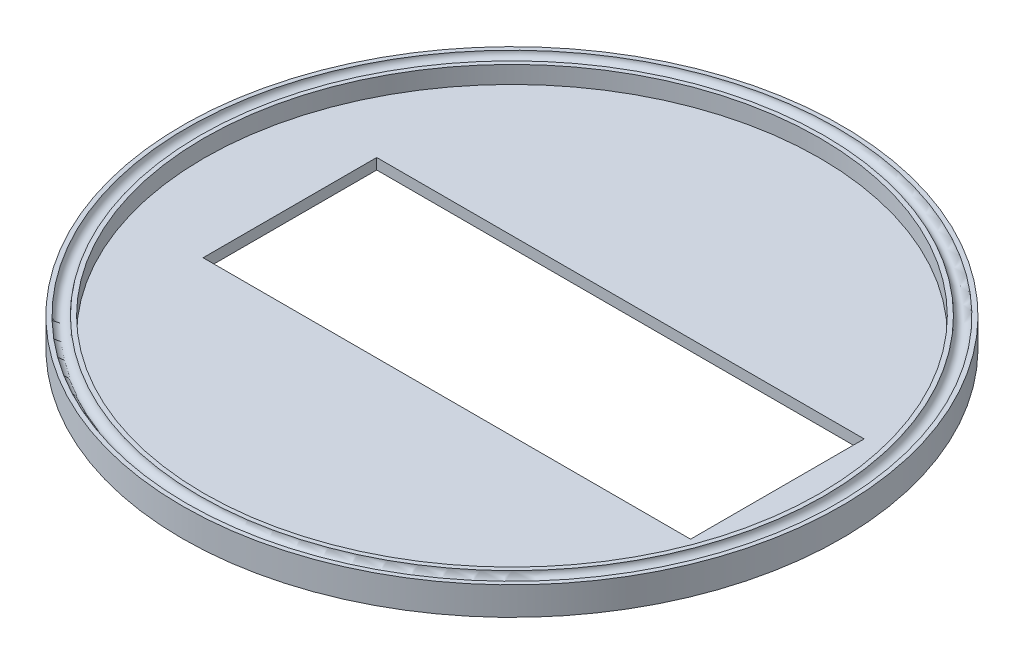
ISO-10303-21;
HEADER;
FILE_DESCRIPTION(('STEP AP214'),'2;1');
FILE_NAME('part.step','',(''),(''),'','','');
FILE_SCHEMA(('AUTOMOTIVE_DESIGN { 1 0 10303 214 1 1 1 1 }'));
ENDSEC;
DATA;
#1=APPLICATION_CONTEXT('core data for automotive mechanical design processes');
#2=APPLICATION_PROTOCOL_DEFINITION('international standard','automotive_design',2000,#1);
#3=PRODUCT_CONTEXT('',#1,'mechanical');
#4=PRODUCT('Part','Part','',(#3));
#5=PRODUCT_RELATED_PRODUCT_CATEGORY('part','',(#4));
#6=PRODUCT_DEFINITION_FORMATION('','',#4);
#7=PRODUCT_DEFINITION_CONTEXT('part definition',#1,'design');
#8=PRODUCT_DEFINITION('design','',#6,#7);
#9=PRODUCT_DEFINITION_SHAPE('','',#8);
#10=(LENGTH_UNIT() NAMED_UNIT(*) SI_UNIT(.MILLI.,.METRE.));
#11=(NAMED_UNIT(*) PLANE_ANGLE_UNIT() SI_UNIT($,.RADIAN.));
#12=(NAMED_UNIT(*) SI_UNIT($,.STERADIAN.) SOLID_ANGLE_UNIT());
#13=UNCERTAINTY_MEASURE_WITH_UNIT(LENGTH_MEASURE(1.E-05),#10,'distance_accuracy_value','');
#14=(GEOMETRIC_REPRESENTATION_CONTEXT(3) GLOBAL_UNCERTAINTY_ASSIGNED_CONTEXT((#13)) GLOBAL_UNIT_ASSIGNED_CONTEXT((#10,
#11,#12)) REPRESENTATION_CONTEXT('',''));
#15=CARTESIAN_POINT('',(0.,0.,0.));
#16=DIRECTION('',(0.,0.,1.));
#17=DIRECTION('',(1.,0.,0.));
#18=AXIS2_PLACEMENT_3D('',#15,#16,#17);
#19=CARTESIAN_POINT('',(0.,6.5,0.));
#20=DIRECTION('',(0.,1.,0.));
#21=DIRECTION('',(0.,0.,1.));
#22=AXIS2_PLACEMENT_3D('',#19,#20,#21);
#23=PLANE('',#22);
#24=CARTESIAN_POINT('',(0.,6.5,0.));
#25=DIRECTION('',(0.,1.,0.));
#26=DIRECTION('',(0.,0.,1.));
#27=AXIS2_PLACEMENT_3D('',#24,#25,#26);
#28=CIRCLE('',#27,75.925);
#29=CARTESIAN_POINT('',(0.,6.5,75.925));
#30=VERTEX_POINT('',#29);
#31=EDGE_CURVE('E135',#30,#30,#28,.T.);
#32=ORIENTED_EDGE('',*,*,#31,.T.);
#33=EDGE_LOOP('',(#32));
#34=FACE_BOUND('',#33,.T.);
#35=CARTESIAN_POINT('',(0.,6.5,0.));
#36=DIRECTION('',(0.,1.,0.));
#37=DIRECTION('',(0.,0.,1.));
#38=AXIS2_PLACEMENT_3D('',#35,#36,#37);
#39=CIRCLE('',#38,74.925);
#40=CARTESIAN_POINT('',(0.,6.5,74.925));
#41=VERTEX_POINT('',#40);
#42=EDGE_CURVE('E12',#41,#41,#39,.T.);
#43=ORIENTED_EDGE('',*,*,#42,.F.);
#44=EDGE_LOOP('',(#43));
#45=FACE_BOUND('',#44,.T.);
#46=ADVANCED_FACE('F57',(#34,#45),#23,.T.);
#47=CARTESIAN_POINT('',(0.,6.5,0.));
#48=DIRECTION('',(0.,1.,0.));
#49=DIRECTION('',(0.,0.,1.));
#50=AXIS2_PLACEMENT_3D('',#47,#48,#49);
#51=CIRCLE('',#50,70.925);
#52=CARTESIAN_POINT('',(0.,6.5,70.925));
#53=VERTEX_POINT('',#52);
#54=EDGE_CURVE('E211',#53,#53,#51,.T.);
#55=ORIENTED_EDGE('',*,*,#54,.F.);
#56=EDGE_LOOP('',(#55));
#57=FACE_BOUND('',#56,.T.);
#58=CARTESIAN_POINT('',(0.,6.5,0.));
#59=DIRECTION('',(0.,-1.,0.));
#60=DIRECTION('',(0.,0.,-1.));
#61=AXIS2_PLACEMENT_3D('',#58,#59,#60);
#62=CIRCLE('',#61,71.925);
#63=CARTESIAN_POINT('',(0.,6.5,71.925));
#64=VERTEX_POINT('',#63);
#65=EDGE_CURVE('E66',#64,#64,#62,.T.);
#66=ORIENTED_EDGE('',*,*,#65,.F.);
#67=EDGE_LOOP('',(#66));
#68=FACE_BOUND('',#67,.T.);
#69=ADVANCED_FACE('F169',(#57,#68),#23,.T.);
#70=CARTESIAN_POINT('',(0.,2.5,0.));
#71=DIRECTION('',(0.,1.,0.));
#72=DIRECTION('',(0.,0.,1.));
#73=AXIS2_PLACEMENT_3D('',#70,#71,#72);
#74=PLANE('',#73);
#75=DIRECTION('',(0.,0.,-1.));
#76=VECTOR('',#75,1.);
#77=CARTESIAN_POINT('',(61.15,2.5,20.));
#78=LINE('',#77,#76);
#79=CARTESIAN_POINT('',(61.15,2.5,20.));
#80=VERTEX_POINT('',#79);
#81=CARTESIAN_POINT('',(61.15,2.5,-20.));
#82=VERTEX_POINT('',#81);
#83=EDGE_CURVE('E107',#80,#82,#78,.T.);
#84=ORIENTED_EDGE('',*,*,#83,.F.);
#85=DIRECTION('',(1.,0.,0.));
#86=VECTOR('',#85,1.);
#87=CARTESIAN_POINT('',(61.15,2.5,20.));
#88=LINE('',#87,#86);
#89=CARTESIAN_POINT('',(-51.15,2.5,20.));
#90=VERTEX_POINT('',#89);
#91=EDGE_CURVE('E128',#90,#80,#88,.T.);
#92=ORIENTED_EDGE('',*,*,#91,.F.);
#93=DIRECTION('',(0.,0.,1.));
#94=VECTOR('',#93,1.);
#95=CARTESIAN_POINT('',(-51.15,2.5,20.));
#96=LINE('',#95,#94);
#97=CARTESIAN_POINT('',(-51.15,2.5,-20.));
#98=VERTEX_POINT('',#97);
#99=EDGE_CURVE('E132',#98,#90,#96,.T.);
#100=ORIENTED_EDGE('',*,*,#99,.F.);
#101=DIRECTION('',(-1.,0.,0.));
#102=VECTOR('',#101,1.);
#103=CARTESIAN_POINT('',(61.15,2.5,-20.));
#104=LINE('',#103,#102);
#105=EDGE_CURVE('E144',#82,#98,#104,.T.);
#106=ORIENTED_EDGE('',*,*,#105,.F.);
#107=EDGE_LOOP('',(#84,#92,#100,#106));
#108=FACE_BOUND('',#107,.T.);
#109=CARTESIAN_POINT('',(0.,2.5,0.));
#110=DIRECTION('',(0.,1.,0.));
#111=DIRECTION('',(0.,0.,1.));
#112=AXIS2_PLACEMENT_3D('',#109,#110,#111);
#113=CIRCLE('',#112,70.925);
#114=CARTESIAN_POINT('',(0.,2.5,70.925));
#115=VERTEX_POINT('',#114);
#116=EDGE_CURVE('E162',#115,#115,#113,.F.);
#117=ORIENTED_EDGE('',*,*,#116,.F.);
#118=EDGE_LOOP('',(#117));
#119=FACE_BOUND('',#118,.T.);
#120=ADVANCED_FACE('F171',(#108,#119),#74,.T.);
#121=CARTESIAN_POINT('',(0.,2.5,0.));
#122=DIRECTION('',(0.,-1.,0.));
#123=DIRECTION('',(0.,0.,-1.));
#124=AXIS2_PLACEMENT_3D('',#121,#122,#123);
#125=CYLINDRICAL_SURFACE('',#124,75.925);
#126=CARTESIAN_POINT('',(0.,0.,0.));
#127=DIRECTION('',(0.,1.,0.));
#128=DIRECTION('',(0.,0.,1.));
#129=AXIS2_PLACEMENT_3D('',#126,#127,#128);
#130=CIRCLE('',#129,75.925);
#131=CARTESIAN_POINT('',(0.,0.,75.925));
#132=VERTEX_POINT('',#131);
#133=EDGE_CURVE('E153',#132,#132,#130,.T.);
#134=ORIENTED_EDGE('',*,*,#133,.T.);
#135=EDGE_LOOP('',(#134));
#136=FACE_BOUND('',#135,.T.);
#137=ORIENTED_EDGE('',*,*,#31,.F.);
#138=EDGE_LOOP('',(#137));
#139=FACE_BOUND('',#138,.T.);
#140=ADVANCED_FACE('F59',(#136,#139),#125,.T.);
#141=CARTESIAN_POINT('',(0.,0.,0.));
#142=DIRECTION('',(0.,1.,0.));
#143=DIRECTION('',(0.,0.,1.));
#144=AXIS2_PLACEMENT_3D('',#141,#142,#143);
#145=PLANE('',#144);
#146=DIRECTION('',(1.,0.,0.));
#147=VECTOR('',#146,1.);
#148=CARTESIAN_POINT('',(61.15,0.,20.));
#149=LINE('',#148,#147);
#150=CARTESIAN_POINT('',(-51.15,0.,20.));
#151=VERTEX_POINT('',#150);
#152=CARTESIAN_POINT('',(61.15,0.,20.));
#153=VERTEX_POINT('',#152);
#154=EDGE_CURVE('E113',#151,#153,#149,.T.);
#155=ORIENTED_EDGE('',*,*,#154,.T.);
#156=DIRECTION('',(0.,0.,-1.));
#157=VECTOR('',#156,1.);
#158=CARTESIAN_POINT('',(61.15,0.,20.));
#159=LINE('',#158,#157);
#160=CARTESIAN_POINT('',(61.15,0.,-20.));
#161=VERTEX_POINT('',#160);
#162=EDGE_CURVE('E104',#153,#161,#159,.T.);
#163=ORIENTED_EDGE('',*,*,#162,.T.);
#164=DIRECTION('',(-1.,0.,0.));
#165=VECTOR('',#164,1.);
#166=CARTESIAN_POINT('',(61.15,0.,-20.));
#167=LINE('',#166,#165);
#168=CARTESIAN_POINT('',(-51.15,0.,-20.));
#169=VERTEX_POINT('',#168);
#170=EDGE_CURVE('E117',#161,#169,#167,.T.);
#171=ORIENTED_EDGE('',*,*,#170,.T.);
#172=DIRECTION('',(0.,0.,1.));
#173=VECTOR('',#172,1.);
#174=CARTESIAN_POINT('',(-51.15,0.,20.));
#175=LINE('',#174,#173);
#176=EDGE_CURVE('E122',#169,#151,#175,.T.);
#177=ORIENTED_EDGE('',*,*,#176,.T.);
#178=EDGE_LOOP('',(#155,#163,#171,#177));
#179=FACE_BOUND('',#178,.T.);
#180=ORIENTED_EDGE('',*,*,#133,.F.);
#181=EDGE_LOOP('',(#180));
#182=FACE_BOUND('',#181,.T.);
#183=ADVANCED_FACE('F124',(#179,#182),#145,.F.);
#184=CARTESIAN_POINT('',(61.15,0.,20.));
#185=DIRECTION('',(1.,0.,0.));
#186=DIRECTION('',(0.,0.,-1.));
#187=AXIS2_PLACEMENT_3D('',#184,#185,#186);
#188=PLANE('',#187);
#189=ORIENTED_EDGE('',*,*,#83,.T.);
#190=DIRECTION('',(0.,1.,0.));
#191=VECTOR('',#190,1.);
#192=CARTESIAN_POINT('',(61.15,0.,-20.));
#193=LINE('',#192,#191);
#194=EDGE_CURVE('E100',#161,#82,#193,.T.);
#195=ORIENTED_EDGE('',*,*,#194,.F.);
#196=ORIENTED_EDGE('',*,*,#162,.F.);
#197=DIRECTION('',(0.,1.,0.));
#198=VECTOR('',#197,1.);
#199=CARTESIAN_POINT('',(61.15,0.,20.));
#200=LINE('',#199,#198);
#201=EDGE_CURVE('E150',#153,#80,#200,.T.);
#202=ORIENTED_EDGE('',*,*,#201,.T.);
#203=EDGE_LOOP('',(#189,#195,#196,#202));
#204=FACE_BOUND('',#203,.T.);
#205=ADVANCED_FACE('F102',(#204),#188,.F.);
#206=CARTESIAN_POINT('',(61.15,0.,20.));
#207=DIRECTION('',(0.,0.,1.));
#208=DIRECTION('',(1.,0.,0.));
#209=AXIS2_PLACEMENT_3D('',#206,#207,#208);
#210=PLANE('',#209);
#211=ORIENTED_EDGE('',*,*,#91,.T.);
#212=ORIENTED_EDGE('',*,*,#201,.F.);
#213=ORIENTED_EDGE('',*,*,#154,.F.);
#214=DIRECTION('',(0.,1.,0.));
#215=VECTOR('',#214,1.);
#216=CARTESIAN_POINT('',(-51.15,0.,20.));
#217=LINE('',#216,#215);
#218=EDGE_CURVE('E154',#151,#90,#217,.T.);
#219=ORIENTED_EDGE('',*,*,#218,.T.);
#220=EDGE_LOOP('',(#211,#212,#213,#219));
#221=FACE_BOUND('',#220,.T.);
#222=ADVANCED_FACE('F187',(#221),#210,.F.);
#223=CARTESIAN_POINT('',(-51.15,0.,20.));
#224=DIRECTION('',(-1.,0.,0.));
#225=DIRECTION('',(0.,0.,1.));
#226=AXIS2_PLACEMENT_3D('',#223,#224,#225);
#227=PLANE('',#226);
#228=ORIENTED_EDGE('',*,*,#99,.T.);
#229=ORIENTED_EDGE('',*,*,#218,.F.);
#230=ORIENTED_EDGE('',*,*,#176,.F.);
#231=DIRECTION('',(0.,1.,0.));
#232=VECTOR('',#231,1.);
#233=CARTESIAN_POINT('',(-51.15,0.,-20.));
#234=LINE('',#233,#232);
#235=EDGE_CURVE('E112',#169,#98,#234,.T.);
#236=ORIENTED_EDGE('',*,*,#235,.T.);
#237=EDGE_LOOP('',(#228,#229,#230,#236));
#238=FACE_BOUND('',#237,.T.);
#239=ADVANCED_FACE('F190',(#238),#227,.F.);
#240=CARTESIAN_POINT('',(61.15,0.,-20.));
#241=DIRECTION('',(0.,0.,-1.));
#242=DIRECTION('',(-1.,0.,0.));
#243=AXIS2_PLACEMENT_3D('',#240,#241,#242);
#244=PLANE('',#243);
#245=ORIENTED_EDGE('',*,*,#105,.T.);
#246=ORIENTED_EDGE('',*,*,#235,.F.);
#247=ORIENTED_EDGE('',*,*,#170,.F.);
#248=ORIENTED_EDGE('',*,*,#194,.T.);
#249=EDGE_LOOP('',(#245,#246,#247,#248));
#250=FACE_BOUND('',#249,.T.);
#251=ADVANCED_FACE('F118',(#250),#244,.F.);
#252=CARTESIAN_POINT('',(0.,6.5,0.));
#253=DIRECTION('',(0.,-1.,0.));
#254=DIRECTION('',(0.,0.,-1.));
#255=AXIS2_PLACEMENT_3D('',#252,#253,#254);
#256=CYLINDRICAL_SURFACE('',#255,70.925);
#257=ORIENTED_EDGE('',*,*,#54,.T.);
#258=EDGE_LOOP('',(#257));
#259=FACE_BOUND('',#258,.T.);
#260=ORIENTED_EDGE('',*,*,#116,.T.);
#261=EDGE_LOOP('',(#260));
#262=FACE_BOUND('',#261,.T.);
#263=ADVANCED_FACE('F185',(#259,#262),#256,.F.);
#264=CARTESIAN_POINT('',(0.,6.5,0.));
#265=DIRECTION('',(0.,1.,0.));
#266=DIRECTION('',(0.,0.,1.));
#267=AXIS2_PLACEMENT_3D('',#264,#265,#266);
#268=TOROIDAL_SURFACE('',#267,73.425,1.5);
#269=ORIENTED_EDGE('',*,*,#42,.T.);
#270=CARTESIAN_POINT('',(0.,6.5,73.425));
#271=DIRECTION('',(1.,0.,0.));
#272=DIRECTION('',(0.,0.,-1.));
#273=AXIS2_PLACEMENT_3D('',#270,#271,#272);
#274=CIRCLE('',#273,1.5);
#275=EDGE_CURVE('E72',#41,#64,#274,.T.);
#276=ORIENTED_EDGE('',*,*,#275,.T.);
#277=ORIENTED_EDGE('',*,*,#65,.T.);
#278=ORIENTED_EDGE('',*,*,#275,.F.);
#279=EDGE_LOOP('',(#269,#276,#277,#278));
#280=FACE_BOUND('',#279,.T.);
#281=ADVANCED_FACE('F167',(#280),#268,.F.);
#282=CLOSED_SHELL('',(#46,#69,#120,#140,#183,#205,#222,#239,#251,#263,#281));
#283=MANIFOLD_SOLID_BREP('B2',#282);
#284=ADVANCED_BREP_SHAPE_REPRESENTATION('',(#18,#283),#14);
#285=SHAPE_DEFINITION_REPRESENTATION(#9,#284);
ENDSEC;
END-ISO-10303-21;
